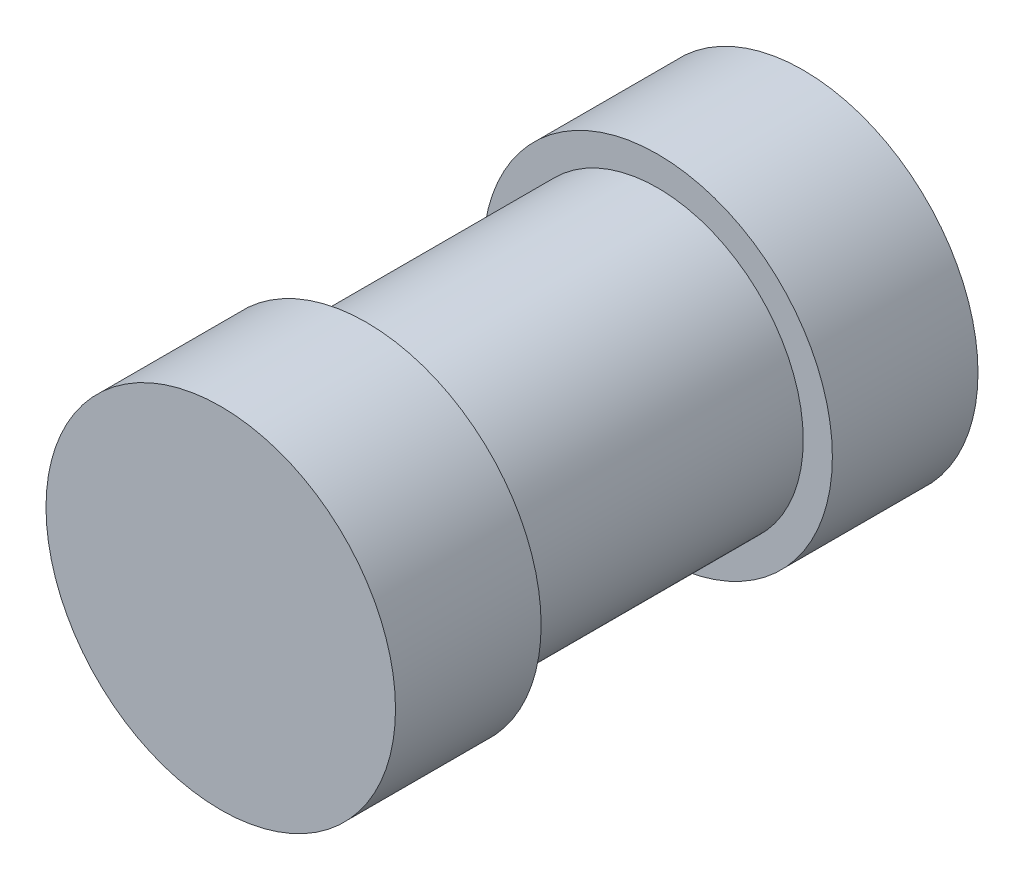
ISO-10303-21;
HEADER;
FILE_DESCRIPTION(('STEP AP214'),'2;1');
FILE_NAME('part.step','',(''),(''),'','','');
FILE_SCHEMA(('AUTOMOTIVE_DESIGN { 1 0 10303 214 1 1 1 1 }'));
ENDSEC;
DATA;
#1=APPLICATION_CONTEXT('core data for automotive mechanical design processes');
#2=APPLICATION_PROTOCOL_DEFINITION('international standard','automotive_design',2000,#1);
#3=PRODUCT_CONTEXT('',#1,'mechanical');
#4=PRODUCT('Part','Part','',(#3));
#5=PRODUCT_RELATED_PRODUCT_CATEGORY('part','',(#4));
#6=PRODUCT_DEFINITION_FORMATION('','',#4);
#7=PRODUCT_DEFINITION_CONTEXT('part definition',#1,'design');
#8=PRODUCT_DEFINITION('design','',#6,#7);
#9=PRODUCT_DEFINITION_SHAPE('','',#8);
#10=(LENGTH_UNIT() NAMED_UNIT(*) SI_UNIT(.MILLI.,.METRE.));
#11=(NAMED_UNIT(*) PLANE_ANGLE_UNIT() SI_UNIT($,.RADIAN.));
#12=(NAMED_UNIT(*) SI_UNIT($,.STERADIAN.) SOLID_ANGLE_UNIT());
#13=UNCERTAINTY_MEASURE_WITH_UNIT(LENGTH_MEASURE(1.E-05),#10,'distance_accuracy_value','');
#14=(GEOMETRIC_REPRESENTATION_CONTEXT(3) GLOBAL_UNCERTAINTY_ASSIGNED_CONTEXT((#13)) GLOBAL_UNIT_ASSIGNED_CONTEXT((#10,
#11,#12)) REPRESENTATION_CONTEXT('',''));
#15=CARTESIAN_POINT('',(0.,0.,0.));
#16=DIRECTION('',(0.,0.,1.));
#17=DIRECTION('',(1.,0.,0.));
#18=AXIS2_PLACEMENT_3D('',#15,#16,#17);
#19=CARTESIAN_POINT('',(0.,0.,6.35));
#20=DIRECTION('',(0.,0.,-1.));
#21=DIRECTION('',(-1.,0.,0.));
#22=AXIS2_PLACEMENT_3D('',#19,#20,#21);
#23=CYLINDRICAL_SURFACE('',#22,3.175);
#24=CARTESIAN_POINT('',(0.,0.,6.35));
#25=DIRECTION('',(0.,0.,1.));
#26=DIRECTION('',(1.,0.,0.));
#27=AXIS2_PLACEMENT_3D('',#24,#25,#26);
#28=CIRCLE('',#27,3.175);
#29=CARTESIAN_POINT('',(3.175,0.,6.35));
#30=VERTEX_POINT('',#29);
#31=EDGE_CURVE('E10',#30,#30,#28,.T.);
#32=ORIENTED_EDGE('',*,*,#31,.F.);
#33=EDGE_LOOP('',(#32));
#34=FACE_BOUND('',#33,.T.);
#35=CARTESIAN_POINT('',(0.,0.,0.));
#36=DIRECTION('',(0.,0.,1.));
#37=DIRECTION('',(1.,0.,0.));
#38=AXIS2_PLACEMENT_3D('',#35,#36,#37);
#39=CIRCLE('',#38,3.175);
#40=CARTESIAN_POINT('',(3.175,0.,0.));
#41=VERTEX_POINT('',#40);
#42=EDGE_CURVE('E42',#41,#41,#39,.T.);
#43=ORIENTED_EDGE('',*,*,#42,.T.);
#44=EDGE_LOOP('',(#43));
#45=FACE_BOUND('',#44,.T.);
#46=ADVANCED_FACE('F39',(#34,#45),#23,.T.);
#47=CARTESIAN_POINT('',(0.,0.,9.525));
#48=DIRECTION('',(0.,0.,-1.));
#49=DIRECTION('',(-1.,0.,0.));
#50=AXIS2_PLACEMENT_3D('',#47,#48,#49);
#51=CYLINDRICAL_SURFACE('',#50,3.81);
#52=CARTESIAN_POINT('',(0.,0.,9.525));
#53=DIRECTION('',(0.,0.,1.));
#54=DIRECTION('',(1.,0.,0.));
#55=AXIS2_PLACEMENT_3D('',#52,#53,#54);
#56=CIRCLE('',#55,3.81);
#57=CARTESIAN_POINT('',(3.81,0.,9.525));
#58=VERTEX_POINT('',#57);
#59=EDGE_CURVE('E46',#58,#58,#56,.T.);
#60=ORIENTED_EDGE('',*,*,#59,.F.);
#61=EDGE_LOOP('',(#60));
#62=FACE_BOUND('',#61,.T.);
#63=CARTESIAN_POINT('',(0.,0.,6.35));
#64=DIRECTION('',(0.,0.,1.));
#65=DIRECTION('',(1.,0.,0.));
#66=AXIS2_PLACEMENT_3D('',#63,#64,#65);
#67=CIRCLE('',#66,3.81);
#68=CARTESIAN_POINT('',(3.81,0.,6.35));
#69=VERTEX_POINT('',#68);
#70=EDGE_CURVE('E50',#69,#69,#67,.T.);
#71=ORIENTED_EDGE('',*,*,#70,.T.);
#72=EDGE_LOOP('',(#71));
#73=FACE_BOUND('',#72,.T.);
#74=ADVANCED_FACE('F87',(#62,#73),#51,.T.);
#75=CARTESIAN_POINT('',(0.,0.,9.525));
#76=DIRECTION('',(0.,0.,1.));
#77=DIRECTION('',(1.,0.,0.));
#78=AXIS2_PLACEMENT_3D('',#75,#76,#77);
#79=PLANE('',#78);
#80=ORIENTED_EDGE('',*,*,#59,.T.);
#81=EDGE_LOOP('',(#80));
#82=FACE_BOUND('',#81,.T.);
#83=ADVANCED_FACE('F83',(#82),#79,.T.);
#84=CARTESIAN_POINT('',(0.,0.,6.35));
#85=DIRECTION('',(0.,0.,1.));
#86=DIRECTION('',(1.,0.,0.));
#87=AXIS2_PLACEMENT_3D('',#84,#85,#86);
#88=PLANE('',#87);
#89=ORIENTED_EDGE('',*,*,#31,.T.);
#90=EDGE_LOOP('',(#89));
#91=FACE_BOUND('',#90,.T.);
#92=ORIENTED_EDGE('',*,*,#70,.F.);
#93=EDGE_LOOP('',(#92));
#94=FACE_BOUND('',#93,.T.);
#95=ADVANCED_FACE('F75',(#91,#94),#88,.F.);
#96=CARTESIAN_POINT('',(0.,0.,-3.175));
#97=DIRECTION('',(0.,0.,1.));
#98=DIRECTION('',(1.,0.,0.));
#99=AXIS2_PLACEMENT_3D('',#96,#97,#98);
#100=CYLINDRICAL_SURFACE('',#99,3.81);
#101=CARTESIAN_POINT('',(0.,0.,-3.175));
#102=DIRECTION('',(0.,0.,-1.));
#103=DIRECTION('',(-1.,0.,0.));
#104=AXIS2_PLACEMENT_3D('',#101,#102,#103);
#105=CIRCLE('',#104,3.81);
#106=CARTESIAN_POINT('',(-3.81,0.,-3.175));
#107=VERTEX_POINT('',#106);
#108=EDGE_CURVE('E58',#107,#107,#105,.T.);
#109=ORIENTED_EDGE('',*,*,#108,.F.);
#110=EDGE_LOOP('',(#109));
#111=FACE_BOUND('',#110,.T.);
#112=CARTESIAN_POINT('',(0.,0.,0.));
#113=DIRECTION('',(0.,0.,-1.));
#114=DIRECTION('',(-1.,0.,0.));
#115=AXIS2_PLACEMENT_3D('',#112,#113,#114);
#116=CIRCLE('',#115,3.81);
#117=CARTESIAN_POINT('',(-3.81,0.,0.));
#118=VERTEX_POINT('',#117);
#119=EDGE_CURVE('E55',#118,#118,#116,.T.);
#120=ORIENTED_EDGE('',*,*,#119,.T.);
#121=EDGE_LOOP('',(#120));
#122=FACE_BOUND('',#121,.T.);
#123=ADVANCED_FACE('F73',(#111,#122),#100,.T.);
#124=CARTESIAN_POINT('',(0.,0.,-3.175));
#125=DIRECTION('',(0.,0.,-1.));
#126=DIRECTION('',(-1.,0.,0.));
#127=AXIS2_PLACEMENT_3D('',#124,#125,#126);
#128=PLANE('',#127);
#129=ORIENTED_EDGE('',*,*,#108,.T.);
#130=EDGE_LOOP('',(#129));
#131=FACE_BOUND('',#130,.T.);
#132=ADVANCED_FACE('F69',(#131),#128,.T.);
#133=CARTESIAN_POINT('',(0.,0.,0.));
#134=DIRECTION('',(0.,0.,-1.));
#135=DIRECTION('',(-1.,0.,0.));
#136=AXIS2_PLACEMENT_3D('',#133,#134,#135);
#137=PLANE('',#136);
#138=ORIENTED_EDGE('',*,*,#42,.F.);
#139=EDGE_LOOP('',(#138));
#140=FACE_BOUND('',#139,.T.);
#141=ORIENTED_EDGE('',*,*,#119,.F.);
#142=EDGE_LOOP('',(#141));
#143=FACE_BOUND('',#142,.T.);
#144=ADVANCED_FACE('F66',(#140,#143),#137,.F.);
#145=CLOSED_SHELL('',(#46,#74,#83,#95,#123,#132,#144));
#146=MANIFOLD_SOLID_BREP('B2',#145);
#147=ADVANCED_BREP_SHAPE_REPRESENTATION('',(#18,#146),#14);
#148=SHAPE_DEFINITION_REPRESENTATION(#9,#147);
ENDSEC;
END-ISO-10303-21;
